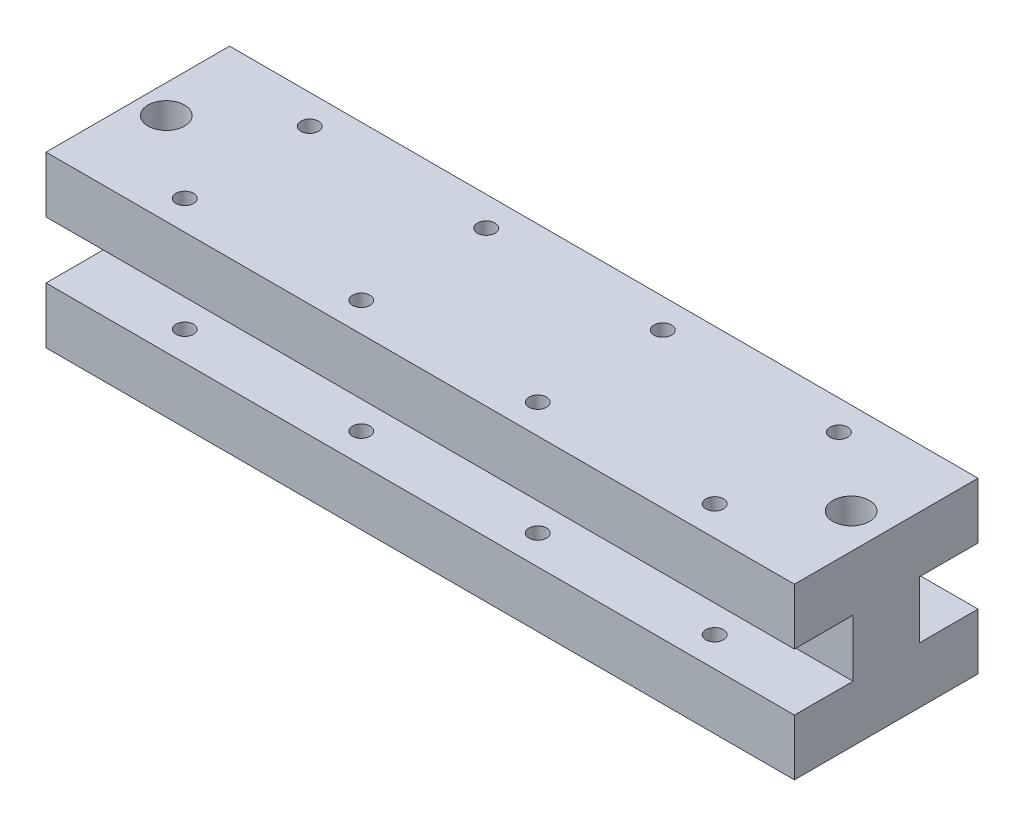
ISO-10303-21;
HEADER;
FILE_DESCRIPTION(('STEP AP214'),'2;1');
FILE_NAME('part.step','',(''),(''),'','','');
FILE_SCHEMA(('AUTOMOTIVE_DESIGN { 1 0 10303 214 1 1 1 1 }'));
ENDSEC;
DATA;
#1=APPLICATION_CONTEXT('core data for automotive mechanical design processes');
#2=APPLICATION_PROTOCOL_DEFINITION('international standard','automotive_design',2000,#1);
#3=PRODUCT_CONTEXT('',#1,'mechanical');
#4=PRODUCT('Part','Part','',(#3));
#5=PRODUCT_RELATED_PRODUCT_CATEGORY('part','',(#4));
#6=PRODUCT_DEFINITION_FORMATION('','',#4);
#7=PRODUCT_DEFINITION_CONTEXT('part definition',#1,'design');
#8=PRODUCT_DEFINITION('design','',#6,#7);
#9=PRODUCT_DEFINITION_SHAPE('','',#8);
#10=(LENGTH_UNIT() NAMED_UNIT(*) SI_UNIT(.MILLI.,.METRE.));
#11=(NAMED_UNIT(*) PLANE_ANGLE_UNIT() SI_UNIT($,.RADIAN.));
#12=(NAMED_UNIT(*) SI_UNIT($,.STERADIAN.) SOLID_ANGLE_UNIT());
#13=UNCERTAINTY_MEASURE_WITH_UNIT(LENGTH_MEASURE(1.E-05),#10,'distance_accuracy_value','');
#14=(GEOMETRIC_REPRESENTATION_CONTEXT(3) GLOBAL_UNCERTAINTY_ASSIGNED_CONTEXT((#13)) GLOBAL_UNIT_ASSIGNED_CONTEXT((#10,
#11,#12)) REPRESENTATION_CONTEXT('',''));
#15=CARTESIAN_POINT('',(0.,0.,0.));
#16=DIRECTION('',(0.,0.,1.));
#17=DIRECTION('',(1.,0.,0.));
#18=AXIS2_PLACEMENT_3D('',#15,#16,#17);
#19=CARTESIAN_POINT('',(-89.8910476017454,-40.65,-13.));
#20=DIRECTION('',(0.,-1.,0.));
#21=DIRECTION('',(0.,0.,-1.));
#22=AXIS2_PLACEMENT_3D('',#19,#20,#21);
#23=PLANE('',#22);
#24=CARTESIAN_POINT('',(11.1406049226985,-40.65,-13.));
#25=DIRECTION('',(0.,-1.,0.));
#26=DIRECTION('',(0.,0.,-1.));
#27=AXIS2_PLACEMENT_3D('',#24,#25,#26);
#28=CIRCLE('',#27,2.59079999999999);
#29=CARTESIAN_POINT('',(11.1406049226985,-40.65,-15.5908));
#30=VERTEX_POINT('',#29);
#31=EDGE_CURVE('E359',#30,#30,#28,.T.);
#32=ORIENTED_EDGE('',*,*,#31,.F.);
#33=EDGE_LOOP('',(#32));
#34=FACE_BOUND('',#33,.T.);
#35=CARTESIAN_POINT('',(-85.8542346336675,-40.65,-13.));
#36=DIRECTION('',(0.,-1.,0.));
#37=DIRECTION('',(0.,0.,-1.));
#38=AXIS2_PLACEMENT_3D('',#35,#36,#37);
#39=CIRCLE('',#38,2.59079999999999);
#40=CARTESIAN_POINT('',(-85.8542346336675,-40.65,-15.5908));
#41=VERTEX_POINT('',#40);
#42=EDGE_CURVE('E353',#41,#41,#39,.T.);
#43=ORIENTED_EDGE('',*,*,#42,.F.);
#44=EDGE_LOOP('',(#43));
#45=FACE_BOUND('',#44,.T.);
#46=DIRECTION('',(1.,0.,0.));
#47=VECTOR('',#46,1.);
#48=CARTESIAN_POINT('',(-89.8910476017454,-40.65,0.));
#49=LINE('',#48,#47);
#50=CARTESIAN_POINT('',(-89.8910476017454,-40.65,0.));
#51=VERTEX_POINT('',#50);
#52=CARTESIAN_POINT('',(16.1089523982546,-40.65,0.));
#53=VERTEX_POINT('',#52);
#54=EDGE_CURVE('E231',#51,#53,#49,.T.);
#55=ORIENTED_EDGE('',*,*,#54,.F.);
#56=DIRECTION('',(0.,0.,1.));
#57=VECTOR('',#56,1.);
#58=CARTESIAN_POINT('',(-89.8910476017454,-40.65,-13.));
#59=LINE('',#58,#57);
#60=CARTESIAN_POINT('',(-89.8910476017454,-40.65,-26.));
#61=VERTEX_POINT('',#60);
#62=EDGE_CURVE('E241',#61,#51,#59,.T.);
#63=ORIENTED_EDGE('',*,*,#62,.F.);
#64=DIRECTION('',(1.,0.,0.));
#65=VECTOR('',#64,1.);
#66=CARTESIAN_POINT('',(-89.8910476017454,-40.65,-26.));
#67=LINE('',#66,#65);
#68=CARTESIAN_POINT('',(16.1089523982546,-40.65,-26.));
#69=VERTEX_POINT('',#68);
#70=EDGE_CURVE('E163',#61,#69,#67,.T.);
#71=ORIENTED_EDGE('',*,*,#70,.T.);
#72=DIRECTION('',(0.,0.,1.));
#73=VECTOR('',#72,1.);
#74=CARTESIAN_POINT('',(16.1089523982546,-40.65,-13.));
#75=LINE('',#74,#73);
#76=EDGE_CURVE('E248',#69,#53,#75,.T.);
#77=ORIENTED_EDGE('',*,*,#76,.T.);
#78=EDGE_LOOP('',(#55,#63,#71,#77));
#79=FACE_BOUND('',#78,.T.);
#80=CARTESIAN_POINT('',(-24.3909856023909,-40.65,-4.15));
#81=DIRECTION('',(0.,1.,0.));
#82=DIRECTION('',(0.,0.,1.));
#83=AXIS2_PLACEMENT_3D('',#80,#81,#82);
#84=CIRCLE('',#83,1.25);
#85=CARTESIAN_POINT('',(-24.3909856023909,-40.65,-2.9));
#86=VERTEX_POINT('',#85);
#87=EDGE_CURVE('E201',#86,#86,#84,.T.);
#88=ORIENTED_EDGE('',*,*,#87,.T.);
#89=EDGE_LOOP('',(#88));
#90=FACE_BOUND('',#89,.T.);
#91=CARTESIAN_POINT('',(0.608952398254592,-40.65,-4.20567731927423));
#92=DIRECTION('',(0.,1.,0.));
#93=DIRECTION('',(0.,0.,1.));
#94=AXIS2_PLACEMENT_3D('',#91,#92,#93);
#95=CIRCLE('',#94,1.25);
#96=CARTESIAN_POINT('',(0.608952398254592,-40.65,-2.95567731927423));
#97=VERTEX_POINT('',#96);
#98=EDGE_CURVE('E189',#97,#97,#95,.T.);
#99=ORIENTED_EDGE('',*,*,#98,.T.);
#100=EDGE_LOOP('',(#99));
#101=FACE_BOUND('',#100,.T.);
#102=CARTESIAN_POINT('',(-49.3909856023909,-40.65,-4.15));
#103=DIRECTION('',(0.,1.,0.));
#104=DIRECTION('',(0.,0.,1.));
#105=AXIS2_PLACEMENT_3D('',#102,#103,#104);
#106=CIRCLE('',#105,1.24999999999999);
#107=CARTESIAN_POINT('',(-49.3909856023909,-40.65,-2.90000000000001));
#108=VERTEX_POINT('',#107);
#109=EDGE_CURVE('E179',#108,#108,#106,.T.);
#110=ORIENTED_EDGE('',*,*,#109,.T.);
#111=EDGE_LOOP('',(#110));
#112=FACE_BOUND('',#111,.T.);
#113=CARTESIAN_POINT('',(-74.3909856023909,-40.65,-4.15));
#114=DIRECTION('',(0.,1.,0.));
#115=DIRECTION('',(0.,0.,1.));
#116=AXIS2_PLACEMENT_3D('',#113,#114,#115);
#117=CIRCLE('',#116,1.25);
#118=CARTESIAN_POINT('',(-74.3909856023909,-40.65,-2.9));
#119=VERTEX_POINT('',#118);
#120=EDGE_CURVE('E169',#119,#119,#117,.T.);
#121=ORIENTED_EDGE('',*,*,#120,.T.);
#122=EDGE_LOOP('',(#121));
#123=FACE_BOUND('',#122,.T.);
#124=CARTESIAN_POINT('',(-24.3909856023909,-40.65,-21.85));
#125=DIRECTION('',(0.,1.,0.));
#126=DIRECTION('',(0.,0.,1.));
#127=AXIS2_PLACEMENT_3D('',#124,#125,#126);
#128=CIRCLE('',#127,1.25);
#129=CARTESIAN_POINT('',(-24.3909856023909,-40.65,-20.6));
#130=VERTEX_POINT('',#129);
#131=EDGE_CURVE('E308',#130,#130,#128,.T.);
#132=ORIENTED_EDGE('',*,*,#131,.T.);
#133=EDGE_LOOP('',(#132));
#134=FACE_BOUND('',#133,.T.);
#135=CARTESIAN_POINT('',(0.608952398254592,-40.65,-21.7943226807258));
#136=DIRECTION('',(0.,1.,0.));
#137=DIRECTION('',(0.,0.,1.));
#138=AXIS2_PLACEMENT_3D('',#135,#136,#137);
#139=CIRCLE('',#138,1.25);
#140=CARTESIAN_POINT('',(0.608952398254592,-40.65,-20.5443226807258));
#141=VERTEX_POINT('',#140);
#142=EDGE_CURVE('E320',#141,#141,#139,.T.);
#143=ORIENTED_EDGE('',*,*,#142,.T.);
#144=EDGE_LOOP('',(#143));
#145=FACE_BOUND('',#144,.T.);
#146=CARTESIAN_POINT('',(-49.3909856023909,-40.65,-21.85));
#147=DIRECTION('',(0.,1.,0.));
#148=DIRECTION('',(0.,0.,1.));
#149=AXIS2_PLACEMENT_3D('',#146,#147,#148);
#150=CIRCLE('',#149,1.24999999999999);
#151=CARTESIAN_POINT('',(-49.3909856023909,-40.65,-20.6));
#152=VERTEX_POINT('',#151);
#153=EDGE_CURVE('E332',#152,#152,#150,.T.);
#154=ORIENTED_EDGE('',*,*,#153,.T.);
#155=EDGE_LOOP('',(#154));
#156=FACE_BOUND('',#155,.T.);
#157=CARTESIAN_POINT('',(-74.3909856023909,-40.65,-21.85));
#158=DIRECTION('',(0.,1.,0.));
#159=DIRECTION('',(0.,0.,1.));
#160=AXIS2_PLACEMENT_3D('',#157,#158,#159);
#161=CIRCLE('',#160,1.25);
#162=CARTESIAN_POINT('',(-74.3909856023909,-40.65,-20.6));
#163=VERTEX_POINT('',#162);
#164=EDGE_CURVE('E344',#163,#163,#161,.T.);
#165=ORIENTED_EDGE('',*,*,#164,.T.);
#166=EDGE_LOOP('',(#165));
#167=FACE_BOUND('',#166,.T.);
#168=ADVANCED_FACE('F37',(#34,#45,#79,#90,#101,#112,#123,#134,#145,#156,#167),#23,.T.);
#169=CARTESIAN_POINT('',(0.,0.,-26.));
#170=DIRECTION('',(0.,0.,-1.));
#171=DIRECTION('',(1.,0.,0.));
#172=AXIS2_PLACEMENT_3D('',#169,#170,#171);
#173=PLANE('',#172);
#174=DIRECTION('',(1.,0.,0.));
#175=VECTOR('',#174,1.);
#176=CARTESIAN_POINT('',(0.,-24.6013169762694,-26.));
#177=LINE('',#176,#175);
#178=CARTESIAN_POINT('',(-89.8910476017454,-24.6013169762694,-26.));
#179=VERTEX_POINT('',#178);
#180=CARTESIAN_POINT('',(16.1089523982546,-24.6013169762694,-26.));
#181=VERTEX_POINT('',#180);
#182=EDGE_CURVE('E11',#179,#181,#177,.T.);
#183=ORIENTED_EDGE('',*,*,#182,.F.);
#184=DIRECTION('',(0.,-1.,0.));
#185=VECTOR('',#184,1.);
#186=CARTESIAN_POINT('',(-89.8910476017454,-16.65,-26.));
#187=LINE('',#186,#185);
#188=CARTESIAN_POINT('',(-89.8910476017454,-16.65,-26.));
#189=VERTEX_POINT('',#188);
#190=EDGE_CURVE('E149',#189,#179,#187,.T.);
#191=ORIENTED_EDGE('',*,*,#190,.F.);
#192=DIRECTION('',(-1.,0.,0.));
#193=VECTOR('',#192,1.);
#194=CARTESIAN_POINT('',(-89.8910476017454,-16.65,-26.));
#195=LINE('',#194,#193);
#196=CARTESIAN_POINT('',(16.1089523982546,-16.65,-26.));
#197=VERTEX_POINT('',#196);
#198=EDGE_CURVE('E156',#197,#189,#195,.T.);
#199=ORIENTED_EDGE('',*,*,#198,.F.);
#200=DIRECTION('',(0.,1.,0.));
#201=VECTOR('',#200,1.);
#202=CARTESIAN_POINT('',(16.1089523982546,-16.65,-26.));
#203=LINE('',#202,#201);
#204=EDGE_CURVE('E159',#181,#197,#203,.T.);
#205=ORIENTED_EDGE('',*,*,#204,.F.);
#206=EDGE_LOOP('',(#183,#191,#199,#205));
#207=FACE_BOUND('',#206,.T.);
#208=ADVANCED_FACE('F299',(#207),#173,.T.);
#209=CARTESIAN_POINT('',(-89.8910476017454,-16.65,-13.));
#210=DIRECTION('',(-1.,0.,0.));
#211=DIRECTION('',(0.,0.,1.));
#212=AXIS2_PLACEMENT_3D('',#209,#210,#211);
#213=PLANE('',#212);
#214=DIRECTION('',(0.,0.,1.));
#215=VECTOR('',#214,1.);
#216=CARTESIAN_POINT('',(-89.8910476017454,-24.6013169762694,-26.000012));
#217=LINE('',#216,#215);
#218=CARTESIAN_POINT('',(-89.8910476017454,-24.6013169762694,-17.7));
#219=VERTEX_POINT('',#218);
#220=EDGE_CURVE('E129',#179,#219,#217,.T.);
#221=ORIENTED_EDGE('',*,*,#220,.T.);
#222=DIRECTION('',(0.,-1.,0.));
#223=VECTOR('',#222,1.);
#224=CARTESIAN_POINT('',(-89.8910476017454,-24.6013169762694,-17.7));
#225=LINE('',#224,#223);
#226=CARTESIAN_POINT('',(-89.8910476017454,-32.7013169762694,-17.7));
#227=VERTEX_POINT('',#226);
#228=EDGE_CURVE('E137',#219,#227,#225,.T.);
#229=ORIENTED_EDGE('',*,*,#228,.T.);
#230=DIRECTION('',(0.,0.,1.));
#231=VECTOR('',#230,1.);
#232=CARTESIAN_POINT('',(-89.8910476017454,-32.7013169762694,-26.000012));
#233=LINE('',#232,#231);
#234=CARTESIAN_POINT('',(-89.8910476017454,-32.7013169762694,-26.));
#235=VERTEX_POINT('',#234);
#236=EDGE_CURVE('E262',#235,#227,#233,.T.);
#237=ORIENTED_EDGE('',*,*,#236,.F.);
#238=EDGE_CURVE('E150',#235,#61,#187,.T.);
#239=ORIENTED_EDGE('',*,*,#238,.T.);
#240=ORIENTED_EDGE('',*,*,#62,.T.);
#241=DIRECTION('',(0.,-1.,0.));
#242=VECTOR('',#241,1.);
#243=CARTESIAN_POINT('',(-89.8910476017454,-16.65,0.));
#244=LINE('',#243,#242);
#245=CARTESIAN_POINT('',(-89.8910476017454,-32.7013169762694,0.));
#246=VERTEX_POINT('',#245);
#247=EDGE_CURVE('E227',#246,#51,#244,.T.);
#248=ORIENTED_EDGE('',*,*,#247,.F.);
#249=DIRECTION('',(0.,0.,-1.));
#250=VECTOR('',#249,1.);
#251=CARTESIAN_POINT('',(-89.8910476017454,-32.7013169762694,1.2E-05));
#252=LINE('',#251,#250);
#253=CARTESIAN_POINT('',(-89.8910476017454,-32.7013169762694,-8.3));
#254=VERTEX_POINT('',#253);
#255=EDGE_CURVE('E224',#246,#254,#252,.T.);
#256=ORIENTED_EDGE('',*,*,#255,.T.);
#257=DIRECTION('',(0.,-1.,0.));
#258=VECTOR('',#257,1.);
#259=CARTESIAN_POINT('',(-89.8910476017454,-24.6013169762694,-8.3));
#260=LINE('',#259,#258);
#261=CARTESIAN_POINT('',(-89.8910476017454,-24.6013169762694,-8.3));
#262=VERTEX_POINT('',#261);
#263=EDGE_CURVE('E208',#262,#254,#260,.T.);
#264=ORIENTED_EDGE('',*,*,#263,.F.);
#265=DIRECTION('',(0.,0.,-1.));
#266=VECTOR('',#265,1.);
#267=CARTESIAN_POINT('',(-89.8910476017454,-24.6013169762694,1.2E-05));
#268=LINE('',#267,#266);
#269=CARTESIAN_POINT('',(-89.8910476017454,-24.6013169762694,0.));
#270=VERTEX_POINT('',#269);
#271=EDGE_CURVE('E219',#270,#262,#268,.T.);
#272=ORIENTED_EDGE('',*,*,#271,.F.);
#273=CARTESIAN_POINT('',(-89.8910476017454,-16.65,0.));
#274=VERTEX_POINT('',#273);
#275=EDGE_CURVE('E228',#274,#270,#244,.T.);
#276=ORIENTED_EDGE('',*,*,#275,.F.);
#277=DIRECTION('',(0.,0.,1.));
#278=VECTOR('',#277,1.);
#279=CARTESIAN_POINT('',(-89.8910476017454,-16.65,-13.));
#280=LINE('',#279,#278);
#281=EDGE_CURVE('E242',#189,#274,#280,.T.);
#282=ORIENTED_EDGE('',*,*,#281,.F.);
#283=ORIENTED_EDGE('',*,*,#190,.T.);
#284=EDGE_LOOP('',(#221,#229,#237,#239,#240,#248,#256,#264,#272,#276,#282,#283));
#285=FACE_BOUND('',#284,.T.);
#286=ADVANCED_FACE('F39',(#285),#213,.T.);
#287=CARTESIAN_POINT('',(16.1089523982546,-16.65,-13.));
#288=DIRECTION('',(1.,0.,0.));
#289=DIRECTION('',(0.,1.,0.));
#290=AXIS2_PLACEMENT_3D('',#287,#288,#289);
#291=PLANE('',#290);
#292=DIRECTION('',(0.,0.,1.));
#293=VECTOR('',#292,1.);
#294=CARTESIAN_POINT('',(16.1089523982546,-24.6013169762694,-26.000012));
#295=LINE('',#294,#293);
#296=CARTESIAN_POINT('',(16.1089523982546,-24.6013169762694,-17.7));
#297=VERTEX_POINT('',#296);
#298=EDGE_CURVE('E132',#181,#297,#295,.T.);
#299=ORIENTED_EDGE('',*,*,#298,.F.);
#300=ORIENTED_EDGE('',*,*,#204,.T.);
#301=DIRECTION('',(0.,0.,1.));
#302=VECTOR('',#301,1.);
#303=CARTESIAN_POINT('',(16.1089523982546,-16.65,-13.));
#304=LINE('',#303,#302);
#305=CARTESIAN_POINT('',(16.1089523982546,-16.65,0.));
#306=VERTEX_POINT('',#305);
#307=EDGE_CURVE('E245',#197,#306,#304,.T.);
#308=ORIENTED_EDGE('',*,*,#307,.T.);
#309=DIRECTION('',(0.,1.,0.));
#310=VECTOR('',#309,1.);
#311=CARTESIAN_POINT('',(16.1089523982546,-16.65,0.));
#312=LINE('',#311,#310);
#313=CARTESIAN_POINT('',(16.1089523982546,-24.6013169762694,0.));
#314=VERTEX_POINT('',#313);
#315=EDGE_CURVE('E234',#314,#306,#312,.T.);
#316=ORIENTED_EDGE('',*,*,#315,.F.);
#317=DIRECTION('',(0.,0.,-1.));
#318=VECTOR('',#317,1.);
#319=CARTESIAN_POINT('',(16.1089523982546,-24.6013169762694,1.2E-05));
#320=LINE('',#319,#318);
#321=CARTESIAN_POINT('',(16.1089523982546,-24.6013169762694,-8.3));
#322=VERTEX_POINT('',#321);
#323=EDGE_CURVE('E60',#314,#322,#320,.T.);
#324=ORIENTED_EDGE('',*,*,#323,.T.);
#325=DIRECTION('',(0.,1.,0.));
#326=VECTOR('',#325,1.);
#327=CARTESIAN_POINT('',(16.1089523982546,-24.6013169762694,-8.3));
#328=LINE('',#327,#326);
#329=CARTESIAN_POINT('',(16.1089523982546,-32.7013169762694,-8.3));
#330=VERTEX_POINT('',#329);
#331=EDGE_CURVE('E214',#330,#322,#328,.T.);
#332=ORIENTED_EDGE('',*,*,#331,.F.);
#333=DIRECTION('',(0.,0.,-1.));
#334=VECTOR('',#333,1.);
#335=CARTESIAN_POINT('',(16.1089523982546,-32.7013169762694,1.2E-05));
#336=LINE('',#335,#334);
#337=CARTESIAN_POINT('',(16.1089523982546,-32.7013169762694,0.));
#338=VERTEX_POINT('',#337);
#339=EDGE_CURVE('E222',#338,#330,#336,.T.);
#340=ORIENTED_EDGE('',*,*,#339,.F.);
#341=EDGE_CURVE('E235',#53,#338,#312,.T.);
#342=ORIENTED_EDGE('',*,*,#341,.F.);
#343=ORIENTED_EDGE('',*,*,#76,.F.);
#344=CARTESIAN_POINT('',(16.1089523982546,-32.7013169762694,-26.));
#345=VERTEX_POINT('',#344);
#346=EDGE_CURVE('E160',#69,#345,#203,.T.);
#347=ORIENTED_EDGE('',*,*,#346,.T.);
#348=DIRECTION('',(0.,0.,1.));
#349=VECTOR('',#348,1.);
#350=CARTESIAN_POINT('',(16.1089523982546,-32.7013169762694,-26.000012));
#351=LINE('',#350,#349);
#352=CARTESIAN_POINT('',(16.1089523982546,-32.7013169762694,-17.7));
#353=VERTEX_POINT('',#352);
#354=EDGE_CURVE('E52',#345,#353,#351,.T.);
#355=ORIENTED_EDGE('',*,*,#354,.T.);
#356=DIRECTION('',(0.,1.,0.));
#357=VECTOR('',#356,1.);
#358=CARTESIAN_POINT('',(16.1089523982546,-24.6013169762694,-17.7));
#359=LINE('',#358,#357);
#360=EDGE_CURVE('E136',#353,#297,#359,.T.);
#361=ORIENTED_EDGE('',*,*,#360,.T.);
#362=EDGE_LOOP('',(#299,#300,#308,#316,#324,#332,#340,#342,#343,#347,#355,#361));
#363=FACE_BOUND('',#362,.T.);
#364=ADVANCED_FACE('F283',(#363),#291,.T.);
#365=CARTESIAN_POINT('',(0.,0.,0.));
#366=DIRECTION('',(0.,0.,1.));
#367=DIRECTION('',(1.,0.,0.));
#368=AXIS2_PLACEMENT_3D('',#365,#366,#367);
#369=PLANE('',#368);
#370=ORIENTED_EDGE('',*,*,#341,.T.);
#371=DIRECTION('',(-1.,0.,0.));
#372=VECTOR('',#371,1.);
#373=CARTESIAN_POINT('',(0.,-32.7013169762694,0.));
#374=LINE('',#373,#372);
#375=EDGE_CURVE('E253',#338,#246,#374,.T.);
#376=ORIENTED_EDGE('',*,*,#375,.T.);
#377=ORIENTED_EDGE('',*,*,#247,.T.);
#378=ORIENTED_EDGE('',*,*,#54,.T.);
#379=EDGE_LOOP('',(#370,#376,#377,#378));
#380=FACE_BOUND('',#379,.T.);
#381=ADVANCED_FACE('F277',(#380),#369,.T.);
#382=ORIENTED_EDGE('',*,*,#275,.T.);
#383=DIRECTION('',(1.,0.,0.));
#384=VECTOR('',#383,1.);
#385=CARTESIAN_POINT('',(0.,-24.6013169762694,0.));
#386=LINE('',#385,#384);
#387=EDGE_CURVE('E244',#270,#314,#386,.T.);
#388=ORIENTED_EDGE('',*,*,#387,.T.);
#389=ORIENTED_EDGE('',*,*,#315,.T.);
#390=DIRECTION('',(-1.,0.,0.));
#391=VECTOR('',#390,1.);
#392=CARTESIAN_POINT('',(-89.8910476017454,-16.65,0.));
#393=LINE('',#392,#391);
#394=EDGE_CURVE('E238',#306,#274,#393,.T.);
#395=ORIENTED_EDGE('',*,*,#394,.T.);
#396=EDGE_LOOP('',(#382,#388,#389,#395));
#397=FACE_BOUND('',#396,.T.);
#398=ADVANCED_FACE('F291',(#397),#369,.T.);
#399=CARTESIAN_POINT('',(-89.8910476017454,-16.65,-13.));
#400=DIRECTION('',(0.,1.,0.));
#401=DIRECTION('',(0.,0.,1.));
#402=AXIS2_PLACEMENT_3D('',#399,#400,#401);
#403=PLANE('',#402);
#404=CARTESIAN_POINT('',(11.1406049226985,-16.65,-13.));
#405=DIRECTION('',(0.,-1.,0.));
#406=DIRECTION('',(0.,0.,-1.));
#407=AXIS2_PLACEMENT_3D('',#404,#405,#406);
#408=CIRCLE('',#407,2.59079999999999);
#409=CARTESIAN_POINT('',(11.1406049226985,-16.65,-15.5908));
#410=VERTEX_POINT('',#409);
#411=EDGE_CURVE('E356',#410,#410,#408,.T.);
#412=ORIENTED_EDGE('',*,*,#411,.T.);
#413=EDGE_LOOP('',(#412));
#414=FACE_BOUND('',#413,.T.);
#415=CARTESIAN_POINT('',(-85.8542346336675,-16.65,-13.));
#416=DIRECTION('',(0.,-1.,0.));
#417=DIRECTION('',(0.,0.,-1.));
#418=AXIS2_PLACEMENT_3D('',#415,#416,#417);
#419=CIRCLE('',#418,2.59079999999999);
#420=CARTESIAN_POINT('',(-85.8542346336675,-16.65,-15.5908));
#421=VERTEX_POINT('',#420);
#422=EDGE_CURVE('E350',#421,#421,#419,.T.);
#423=ORIENTED_EDGE('',*,*,#422,.T.);
#424=EDGE_LOOP('',(#423));
#425=FACE_BOUND('',#424,.T.);
#426=CARTESIAN_POINT('',(-74.3909856023909,-16.65,-21.85));
#427=DIRECTION('',(0.,1.,0.));
#428=DIRECTION('',(0.,0.,1.));
#429=AXIS2_PLACEMENT_3D('',#426,#427,#428);
#430=CIRCLE('',#429,1.25);
#431=CARTESIAN_POINT('',(-74.3909856023909,-16.65,-20.6));
#432=VERTEX_POINT('',#431);
#433=EDGE_CURVE('E347',#432,#432,#430,.T.);
#434=ORIENTED_EDGE('',*,*,#433,.F.);
#435=EDGE_LOOP('',(#434));
#436=FACE_BOUND('',#435,.T.);
#437=CARTESIAN_POINT('',(-49.3909856023909,-16.65,-21.85));
#438=DIRECTION('',(0.,1.,0.));
#439=DIRECTION('',(0.,0.,1.));
#440=AXIS2_PLACEMENT_3D('',#437,#438,#439);
#441=CIRCLE('',#440,1.24999999999999);
#442=CARTESIAN_POINT('',(-49.3909856023909,-16.65,-20.6));
#443=VERTEX_POINT('',#442);
#444=EDGE_CURVE('E335',#443,#443,#441,.T.);
#445=ORIENTED_EDGE('',*,*,#444,.F.);
#446=EDGE_LOOP('',(#445));
#447=FACE_BOUND('',#446,.T.);
#448=CARTESIAN_POINT('',(0.608952398254592,-16.65,-21.7943226807258));
#449=DIRECTION('',(0.,1.,0.));
#450=DIRECTION('',(0.,0.,1.));
#451=AXIS2_PLACEMENT_3D('',#448,#449,#450);
#452=CIRCLE('',#451,1.25);
#453=CARTESIAN_POINT('',(0.608952398254592,-16.65,-20.5443226807258));
#454=VERTEX_POINT('',#453);
#455=EDGE_CURVE('E323',#454,#454,#452,.T.);
#456=ORIENTED_EDGE('',*,*,#455,.F.);
#457=EDGE_LOOP('',(#456));
#458=FACE_BOUND('',#457,.T.);
#459=CARTESIAN_POINT('',(-24.3909856023909,-16.65,-21.85));
#460=DIRECTION('',(0.,1.,0.));
#461=DIRECTION('',(0.,0.,1.));
#462=AXIS2_PLACEMENT_3D('',#459,#460,#461);
#463=CIRCLE('',#462,1.25);
#464=CARTESIAN_POINT('',(-24.3909856023909,-16.65,-20.6));
#465=VERTEX_POINT('',#464);
#466=EDGE_CURVE('E311',#465,#465,#463,.T.);
#467=ORIENTED_EDGE('',*,*,#466,.F.);
#468=EDGE_LOOP('',(#467));
#469=FACE_BOUND('',#468,.T.);
#470=CARTESIAN_POINT('',(-74.3909856023909,-16.65,-4.15));
#471=DIRECTION('',(0.,1.,0.));
#472=DIRECTION('',(0.,0.,1.));
#473=AXIS2_PLACEMENT_3D('',#470,#471,#472);
#474=CIRCLE('',#473,1.25);
#475=CARTESIAN_POINT('',(-74.3909856023909,-16.65,-2.9));
#476=VERTEX_POINT('',#475);
#477=EDGE_CURVE('E166',#476,#476,#474,.T.);
#478=ORIENTED_EDGE('',*,*,#477,.F.);
#479=EDGE_LOOP('',(#478));
#480=FACE_BOUND('',#479,.T.);
#481=CARTESIAN_POINT('',(-49.3909856023909,-16.65,-4.15));
#482=DIRECTION('',(0.,1.,0.));
#483=DIRECTION('',(0.,0.,1.));
#484=AXIS2_PLACEMENT_3D('',#481,#482,#483);
#485=CIRCLE('',#484,1.24999999999999);
#486=CARTESIAN_POINT('',(-49.3909856023909,-16.65,-2.90000000000001));
#487=VERTEX_POINT('',#486);
#488=EDGE_CURVE('E176',#487,#487,#485,.T.);
#489=ORIENTED_EDGE('',*,*,#488,.F.);
#490=EDGE_LOOP('',(#489));
#491=FACE_BOUND('',#490,.T.);
#492=CARTESIAN_POINT('',(0.608952398254592,-16.65,-4.20567731927423));
#493=DIRECTION('',(0.,1.,0.));
#494=DIRECTION('',(0.,0.,1.));
#495=AXIS2_PLACEMENT_3D('',#492,#493,#494);
#496=CIRCLE('',#495,1.25);
#497=CARTESIAN_POINT('',(0.608952398254592,-16.65,-2.95567731927423));
#498=VERTEX_POINT('',#497);
#499=EDGE_CURVE('E186',#498,#498,#496,.T.);
#500=ORIENTED_EDGE('',*,*,#499,.F.);
#501=EDGE_LOOP('',(#500));
#502=FACE_BOUND('',#501,.T.);
#503=CARTESIAN_POINT('',(-24.3909856023909,-16.65,-4.15));
#504=DIRECTION('',(0.,1.,0.));
#505=DIRECTION('',(0.,0.,1.));
#506=AXIS2_PLACEMENT_3D('',#503,#504,#505);
#507=CIRCLE('',#506,1.25);
#508=CARTESIAN_POINT('',(-24.3909856023909,-16.65,-2.9));
#509=VERTEX_POINT('',#508);
#510=EDGE_CURVE('E198',#509,#509,#507,.T.);
#511=ORIENTED_EDGE('',*,*,#510,.F.);
#512=EDGE_LOOP('',(#511));
#513=FACE_BOUND('',#512,.T.);
#514=ORIENTED_EDGE('',*,*,#394,.F.);
#515=ORIENTED_EDGE('',*,*,#307,.F.);
#516=ORIENTED_EDGE('',*,*,#198,.T.);
#517=ORIENTED_EDGE('',*,*,#281,.T.);
#518=EDGE_LOOP('',(#514,#515,#516,#517));
#519=FACE_BOUND('',#518,.T.);
#520=ADVANCED_FACE('F295',(#414,#425,#436,#447,#458,#469,#480,#491,#502,#513,#519),#403,.T.);
#521=CARTESIAN_POINT('',(-89.8910476017454,-32.7013169762694,1.2E-05));
#522=DIRECTION('',(0.,1.,0.));
#523=DIRECTION('',(0.,0.,1.));
#524=AXIS2_PLACEMENT_3D('',#521,#522,#523);
#525=PLANE('',#524);
#526=CARTESIAN_POINT('',(-74.3909856023909,-32.7013169762694,-4.15));
#527=DIRECTION('',(0.,1.,0.));
#528=DIRECTION('',(0.,0.,1.));
#529=AXIS2_PLACEMENT_3D('',#526,#527,#528);
#530=CIRCLE('',#529,1.25);
#531=CARTESIAN_POINT('',(-74.3909856023909,-32.7013169762694,-2.9));
#532=VERTEX_POINT('',#531);
#533=EDGE_CURVE('E173',#532,#532,#530,.T.);
#534=ORIENTED_EDGE('',*,*,#533,.F.);
#535=EDGE_LOOP('',(#534));
#536=FACE_BOUND('',#535,.T.);
#537=CARTESIAN_POINT('',(-49.3909856023909,-32.7013169762694,-4.15));
#538=DIRECTION('',(0.,1.,0.));
#539=DIRECTION('',(0.,0.,1.));
#540=AXIS2_PLACEMENT_3D('',#537,#538,#539);
#541=CIRCLE('',#540,1.24999999999999);
#542=CARTESIAN_POINT('',(-49.3909856023909,-32.7013169762694,-2.90000000000001));
#543=VERTEX_POINT('',#542);
#544=EDGE_CURVE('E183',#543,#543,#541,.T.);
#545=ORIENTED_EDGE('',*,*,#544,.F.);
#546=EDGE_LOOP('',(#545));
#547=FACE_BOUND('',#546,.T.);
#548=CARTESIAN_POINT('',(0.608952398254592,-32.7013169762694,-4.20567731927423));
#549=DIRECTION('',(0.,1.,0.));
#550=DIRECTION('',(0.,0.,1.));
#551=AXIS2_PLACEMENT_3D('',#548,#549,#550);
#552=CIRCLE('',#551,1.25);
#553=CARTESIAN_POINT('',(0.608952398254592,-32.7013169762694,-2.95567731927423));
#554=VERTEX_POINT('',#553);
#555=EDGE_CURVE('E195',#554,#554,#552,.T.);
#556=ORIENTED_EDGE('',*,*,#555,.F.);
#557=EDGE_LOOP('',(#556));
#558=FACE_BOUND('',#557,.T.);
#559=CARTESIAN_POINT('',(-24.3909856023909,-32.7013169762694,-4.15));
#560=DIRECTION('',(0.,1.,0.));
#561=DIRECTION('',(0.,0.,1.));
#562=AXIS2_PLACEMENT_3D('',#559,#560,#561);
#563=CIRCLE('',#562,1.25);
#564=CARTESIAN_POINT('',(-24.3909856023909,-32.7013169762694,-2.9));
#565=VERTEX_POINT('',#564);
#566=EDGE_CURVE('E205',#565,#565,#563,.T.);
#567=ORIENTED_EDGE('',*,*,#566,.F.);
#568=EDGE_LOOP('',(#567));
#569=FACE_BOUND('',#568,.T.);
#570=ORIENTED_EDGE('',*,*,#339,.T.);
#571=DIRECTION('',(1.,0.,0.));
#572=VECTOR('',#571,1.);
#573=CARTESIAN_POINT('',(-89.8910476017454,-32.7013169762694,-8.3));
#574=LINE('',#573,#572);
#575=EDGE_CURVE('E211',#254,#330,#574,.T.);
#576=ORIENTED_EDGE('',*,*,#575,.F.);
#577=ORIENTED_EDGE('',*,*,#255,.F.);
#578=ORIENTED_EDGE('',*,*,#375,.F.);
#579=EDGE_LOOP('',(#570,#576,#577,#578));
#580=FACE_BOUND('',#579,.T.);
#581=ADVANCED_FACE('F280',(#536,#547,#558,#569,#580),#525,.T.);
#582=CARTESIAN_POINT('',(-89.8910476017454,-24.6013169762694,1.2E-05));
#583=DIRECTION('',(0.,-1.,0.));
#584=DIRECTION('',(0.,0.,-1.));
#585=AXIS2_PLACEMENT_3D('',#582,#583,#584);
#586=PLANE('',#585);
#587=CARTESIAN_POINT('',(-74.3909856023909,-24.6013169762694,-4.15));
#588=DIRECTION('',(0.,-1.,0.));
#589=DIRECTION('',(0.,0.,-1.));
#590=AXIS2_PLACEMENT_3D('',#587,#588,#589);
#591=CIRCLE('',#590,1.25);
#592=CARTESIAN_POINT('',(-74.3909856023909,-24.6013169762694,-5.4));
#593=VERTEX_POINT('',#592);
#594=EDGE_CURVE('E172',#593,#593,#591,.T.);
#595=ORIENTED_EDGE('',*,*,#594,.F.);
#596=EDGE_LOOP('',(#595));
#597=FACE_BOUND('',#596,.T.);
#598=CARTESIAN_POINT('',(-49.3909856023909,-24.6013169762694,-4.15));
#599=DIRECTION('',(0.,-1.,0.));
#600=DIRECTION('',(0.,0.,-1.));
#601=AXIS2_PLACEMENT_3D('',#598,#599,#600);
#602=CIRCLE('',#601,1.24999999999999);
#603=CARTESIAN_POINT('',(-49.3909856023909,-24.6013169762694,-5.39999999999999));
#604=VERTEX_POINT('',#603);
#605=EDGE_CURVE('E182',#604,#604,#602,.T.);
#606=ORIENTED_EDGE('',*,*,#605,.F.);
#607=EDGE_LOOP('',(#606));
#608=FACE_BOUND('',#607,.T.);
#609=CARTESIAN_POINT('',(0.608952398254592,-24.6013169762694,-4.20567731927423));
#610=DIRECTION('',(0.,-1.,0.));
#611=DIRECTION('',(0.,0.,-1.));
#612=AXIS2_PLACEMENT_3D('',#609,#610,#611);
#613=CIRCLE('',#612,1.25);
#614=CARTESIAN_POINT('',(0.608952398254592,-24.6013169762694,-5.45567731927422));
#615=VERTEX_POINT('',#614);
#616=EDGE_CURVE('E192',#615,#615,#613,.T.);
#617=ORIENTED_EDGE('',*,*,#616,.F.);
#618=EDGE_LOOP('',(#617));
#619=FACE_BOUND('',#618,.T.);
#620=CARTESIAN_POINT('',(-24.3909856023909,-24.6013169762694,-4.15));
#621=DIRECTION('',(0.,-1.,0.));
#622=DIRECTION('',(0.,0.,-1.));
#623=AXIS2_PLACEMENT_3D('',#620,#621,#622);
#624=CIRCLE('',#623,1.25);
#625=CARTESIAN_POINT('',(-24.3909856023909,-24.6013169762694,-5.4));
#626=VERTEX_POINT('',#625);
#627=EDGE_CURVE('E204',#626,#626,#624,.T.);
#628=ORIENTED_EDGE('',*,*,#627,.F.);
#629=EDGE_LOOP('',(#628));
#630=FACE_BOUND('',#629,.T.);
#631=ORIENTED_EDGE('',*,*,#271,.T.);
#632=DIRECTION('',(-1.,0.,0.));
#633=VECTOR('',#632,1.);
#634=CARTESIAN_POINT('',(-89.8910476017454,-24.6013169762694,-8.3));
#635=LINE('',#634,#633);
#636=EDGE_CURVE('E216',#322,#262,#635,.T.);
#637=ORIENTED_EDGE('',*,*,#636,.F.);
#638=ORIENTED_EDGE('',*,*,#323,.F.);
#639=ORIENTED_EDGE('',*,*,#387,.F.);
#640=EDGE_LOOP('',(#631,#637,#638,#639));
#641=FACE_BOUND('',#640,.T.);
#642=ADVANCED_FACE('F287',(#597,#608,#619,#630,#641),#586,.T.);
#643=CARTESIAN_POINT('',(0.,0.,-8.3));
#644=DIRECTION('',(0.,0.,1.));
#645=DIRECTION('',(1.,0.,0.));
#646=AXIS2_PLACEMENT_3D('',#643,#644,#645);
#647=PLANE('',#646);
#648=ORIENTED_EDGE('',*,*,#263,.T.);
#649=ORIENTED_EDGE('',*,*,#575,.T.);
#650=ORIENTED_EDGE('',*,*,#331,.T.);
#651=ORIENTED_EDGE('',*,*,#636,.T.);
#652=EDGE_LOOP('',(#648,#649,#650,#651));
#653=FACE_BOUND('',#652,.T.);
#654=ADVANCED_FACE('F286',(#653),#647,.T.);
#655=CARTESIAN_POINT('',(-24.3909856023909,-16.65,-4.15));
#656=DIRECTION('',(0.,1.,0.));
#657=DIRECTION('',(0.,0.,1.));
#658=AXIS2_PLACEMENT_3D('',#655,#656,#657);
#659=CYLINDRICAL_SURFACE('',#658,1.25);
#660=ORIENTED_EDGE('',*,*,#627,.T.);
#661=EDGE_LOOP('',(#660));
#662=FACE_BOUND('',#661,.T.);
#663=ORIENTED_EDGE('',*,*,#510,.T.);
#664=EDGE_LOOP('',(#663));
#665=FACE_BOUND('',#664,.T.);
#666=ADVANCED_FACE('F426',(#662,#665),#659,.F.);
#667=ORIENTED_EDGE('',*,*,#566,.T.);
#668=EDGE_LOOP('',(#667));
#669=FACE_BOUND('',#668,.T.);
#670=ORIENTED_EDGE('',*,*,#87,.F.);
#671=EDGE_LOOP('',(#670));
#672=FACE_BOUND('',#671,.T.);
#673=ADVANCED_FACE('F424',(#669,#672),#659,.F.);
#674=CARTESIAN_POINT('',(0.608952398254592,-16.65,-4.20567731927423));
#675=DIRECTION('',(0.,1.,0.));
#676=DIRECTION('',(0.,0.,1.));
#677=AXIS2_PLACEMENT_3D('',#674,#675,#676);
#678=CYLINDRICAL_SURFACE('',#677,1.25);
#679=ORIENTED_EDGE('',*,*,#616,.T.);
#680=EDGE_LOOP('',(#679));
#681=FACE_BOUND('',#680,.T.);
#682=ORIENTED_EDGE('',*,*,#499,.T.);
#683=EDGE_LOOP('',(#682));
#684=FACE_BOUND('',#683,.T.);
#685=ADVANCED_FACE('F421',(#681,#684),#678,.F.);
#686=ORIENTED_EDGE('',*,*,#555,.T.);
#687=EDGE_LOOP('',(#686));
#688=FACE_BOUND('',#687,.T.);
#689=ORIENTED_EDGE('',*,*,#98,.F.);
#690=EDGE_LOOP('',(#689));
#691=FACE_BOUND('',#690,.T.);
#692=ADVANCED_FACE('F419',(#688,#691),#678,.F.);
#693=CARTESIAN_POINT('',(-49.3909856023909,-16.65,-4.15));
#694=DIRECTION('',(0.,1.,0.));
#695=DIRECTION('',(0.,0.,1.));
#696=AXIS2_PLACEMENT_3D('',#693,#694,#695);
#697=CYLINDRICAL_SURFACE('',#696,1.24999999999999);
#698=ORIENTED_EDGE('',*,*,#605,.T.);
#699=EDGE_LOOP('',(#698));
#700=FACE_BOUND('',#699,.T.);
#701=ORIENTED_EDGE('',*,*,#488,.T.);
#702=EDGE_LOOP('',(#701));
#703=FACE_BOUND('',#702,.T.);
#704=ADVANCED_FACE('F416',(#700,#703),#697,.F.);
#705=ORIENTED_EDGE('',*,*,#544,.T.);
#706=EDGE_LOOP('',(#705));
#707=FACE_BOUND('',#706,.T.);
#708=ORIENTED_EDGE('',*,*,#109,.F.);
#709=EDGE_LOOP('',(#708));
#710=FACE_BOUND('',#709,.T.);
#711=ADVANCED_FACE('F414',(#707,#710),#697,.F.);
#712=CARTESIAN_POINT('',(-74.3909856023909,-16.65,-4.15));
#713=DIRECTION('',(0.,1.,0.));
#714=DIRECTION('',(0.,0.,1.));
#715=AXIS2_PLACEMENT_3D('',#712,#713,#714);
#716=CYLINDRICAL_SURFACE('',#715,1.25);
#717=ORIENTED_EDGE('',*,*,#594,.T.);
#718=EDGE_LOOP('',(#717));
#719=FACE_BOUND('',#718,.T.);
#720=ORIENTED_EDGE('',*,*,#477,.T.);
#721=EDGE_LOOP('',(#720));
#722=FACE_BOUND('',#721,.T.);
#723=ADVANCED_FACE('F411',(#719,#722),#716,.F.);
#724=ORIENTED_EDGE('',*,*,#533,.T.);
#725=EDGE_LOOP('',(#724));
#726=FACE_BOUND('',#725,.T.);
#727=ORIENTED_EDGE('',*,*,#120,.F.);
#728=EDGE_LOOP('',(#727));
#729=FACE_BOUND('',#728,.T.);
#730=ADVANCED_FACE('F410',(#726,#729),#716,.F.);
#731=DIRECTION('',(-1.,0.,0.));
#732=VECTOR('',#731,1.);
#733=CARTESIAN_POINT('',(0.,-32.7013169762694,-26.));
#734=LINE('',#733,#732);
#735=EDGE_CURVE('E45',#345,#235,#734,.T.);
#736=ORIENTED_EDGE('',*,*,#735,.F.);
#737=ORIENTED_EDGE('',*,*,#346,.F.);
#738=ORIENTED_EDGE('',*,*,#70,.F.);
#739=ORIENTED_EDGE('',*,*,#238,.F.);
#740=EDGE_LOOP('',(#736,#737,#738,#739));
#741=FACE_BOUND('',#740,.T.);
#742=ADVANCED_FACE('F269',(#741),#173,.T.);
#743=CARTESIAN_POINT('',(-89.8910476017454,-24.6013169762694,-26.000012));
#744=DIRECTION('',(0.,1.,0.));
#745=DIRECTION('',(0.,0.,1.));
#746=AXIS2_PLACEMENT_3D('',#743,#744,#745);
#747=PLANE('',#746);
#748=CARTESIAN_POINT('',(-74.3909856023909,-24.6013169762694,-21.85));
#749=DIRECTION('',(0.,1.,0.));
#750=DIRECTION('',(0.,0.,1.));
#751=AXIS2_PLACEMENT_3D('',#748,#749,#750);
#752=CIRCLE('',#751,1.25);
#753=CARTESIAN_POINT('',(-74.3909856023909,-24.6013169762694,-20.6));
#754=VERTEX_POINT('',#753);
#755=EDGE_CURVE('E341',#754,#754,#752,.T.);
#756=ORIENTED_EDGE('',*,*,#755,.T.);
#757=EDGE_LOOP('',(#756));
#758=FACE_BOUND('',#757,.T.);
#759=CARTESIAN_POINT('',(-49.3909856023909,-24.6013169762694,-21.85));
#760=DIRECTION('',(0.,1.,0.));
#761=DIRECTION('',(0.,0.,1.));
#762=AXIS2_PLACEMENT_3D('',#759,#760,#761);
#763=CIRCLE('',#762,1.24999999999999);
#764=CARTESIAN_POINT('',(-49.3909856023909,-24.6013169762694,-20.6));
#765=VERTEX_POINT('',#764);
#766=EDGE_CURVE('E329',#765,#765,#763,.T.);
#767=ORIENTED_EDGE('',*,*,#766,.T.);
#768=EDGE_LOOP('',(#767));
#769=FACE_BOUND('',#768,.T.);
#770=CARTESIAN_POINT('',(0.608952398254592,-24.6013169762694,-21.7943226807258));
#771=DIRECTION('',(0.,1.,0.));
#772=DIRECTION('',(0.,0.,1.));
#773=AXIS2_PLACEMENT_3D('',#770,#771,#772);
#774=CIRCLE('',#773,1.25);
#775=CARTESIAN_POINT('',(0.608952398254592,-24.6013169762694,-20.5443226807258));
#776=VERTEX_POINT('',#775);
#777=EDGE_CURVE('E317',#776,#776,#774,.T.);
#778=ORIENTED_EDGE('',*,*,#777,.T.);
#779=EDGE_LOOP('',(#778));
#780=FACE_BOUND('',#779,.T.);
#781=CARTESIAN_POINT('',(-24.3909856023909,-24.6013169762694,-21.85));
#782=DIRECTION('',(0.,1.,0.));
#783=DIRECTION('',(0.,0.,1.));
#784=AXIS2_PLACEMENT_3D('',#781,#782,#783);
#785=CIRCLE('',#784,1.25);
#786=CARTESIAN_POINT('',(-24.3909856023909,-24.6013169762694,-20.6));
#787=VERTEX_POINT('',#786);
#788=EDGE_CURVE('E145',#787,#787,#785,.T.);
#789=ORIENTED_EDGE('',*,*,#788,.T.);
#790=EDGE_LOOP('',(#789));
#791=FACE_BOUND('',#790,.T.);
#792=ORIENTED_EDGE('',*,*,#182,.T.);
#793=ORIENTED_EDGE('',*,*,#298,.T.);
#794=DIRECTION('',(-1.,0.,0.));
#795=VECTOR('',#794,1.);
#796=CARTESIAN_POINT('',(-89.8910476017454,-24.6013169762694,-17.7));
#797=LINE('',#796,#795);
#798=EDGE_CURVE('E125',#297,#219,#797,.T.);
#799=ORIENTED_EDGE('',*,*,#798,.T.);
#800=ORIENTED_EDGE('',*,*,#220,.F.);
#801=EDGE_LOOP('',(#792,#793,#799,#800));
#802=FACE_BOUND('',#801,.T.);
#803=ADVANCED_FACE('F127',(#758,#769,#780,#791,#802),#747,.F.);
#804=CARTESIAN_POINT('',(-89.8910476017454,-32.7013169762694,-26.000012));
#805=DIRECTION('',(0.,-1.,0.));
#806=DIRECTION('',(0.,0.,-1.));
#807=AXIS2_PLACEMENT_3D('',#804,#805,#806);
#808=PLANE('',#807);
#809=CARTESIAN_POINT('',(-74.3909856023909,-32.7013169762694,-21.85));
#810=DIRECTION('',(0.,-1.,0.));
#811=DIRECTION('',(0.,0.,-1.));
#812=AXIS2_PLACEMENT_3D('',#809,#810,#811);
#813=CIRCLE('',#812,1.25);
#814=CARTESIAN_POINT('',(-74.3909856023909,-32.7013169762694,-23.1));
#815=VERTEX_POINT('',#814);
#816=EDGE_CURVE('E338',#815,#815,#813,.T.);
#817=ORIENTED_EDGE('',*,*,#816,.T.);
#818=EDGE_LOOP('',(#817));
#819=FACE_BOUND('',#818,.T.);
#820=CARTESIAN_POINT('',(-49.3909856023909,-32.7013169762694,-21.85));
#821=DIRECTION('',(0.,-1.,0.));
#822=DIRECTION('',(0.,0.,-1.));
#823=AXIS2_PLACEMENT_3D('',#820,#821,#822);
#824=CIRCLE('',#823,1.24999999999999);
#825=CARTESIAN_POINT('',(-49.3909856023909,-32.7013169762694,-23.1));
#826=VERTEX_POINT('',#825);
#827=EDGE_CURVE('E326',#826,#826,#824,.T.);
#828=ORIENTED_EDGE('',*,*,#827,.T.);
#829=EDGE_LOOP('',(#828));
#830=FACE_BOUND('',#829,.T.);
#831=CARTESIAN_POINT('',(0.608952398254592,-32.7013169762694,-21.7943226807258));
#832=DIRECTION('',(0.,-1.,0.));
#833=DIRECTION('',(0.,0.,-1.));
#834=AXIS2_PLACEMENT_3D('',#831,#832,#833);
#835=CIRCLE('',#834,1.25);
#836=CARTESIAN_POINT('',(0.608952398254592,-32.7013169762694,-23.0443226807258));
#837=VERTEX_POINT('',#836);
#838=EDGE_CURVE('E314',#837,#837,#835,.T.);
#839=ORIENTED_EDGE('',*,*,#838,.T.);
#840=EDGE_LOOP('',(#839));
#841=FACE_BOUND('',#840,.T.);
#842=CARTESIAN_POINT('',(-24.3909856023909,-32.7013169762694,-21.85));
#843=DIRECTION('',(0.,-1.,0.));
#844=DIRECTION('',(0.,0.,-1.));
#845=AXIS2_PLACEMENT_3D('',#842,#843,#844);
#846=CIRCLE('',#845,1.25);
#847=CARTESIAN_POINT('',(-24.3909856023909,-32.7013169762694,-23.1));
#848=VERTEX_POINT('',#847);
#849=EDGE_CURVE('E305',#848,#848,#846,.T.);
#850=ORIENTED_EDGE('',*,*,#849,.T.);
#851=EDGE_LOOP('',(#850));
#852=FACE_BOUND('',#851,.T.);
#853=ORIENTED_EDGE('',*,*,#735,.T.);
#854=ORIENTED_EDGE('',*,*,#236,.T.);
#855=DIRECTION('',(1.,0.,0.));
#856=VECTOR('',#855,1.);
#857=CARTESIAN_POINT('',(-89.8910476017454,-32.7013169762694,-17.7));
#858=LINE('',#857,#856);
#859=EDGE_CURVE('E142',#227,#353,#858,.T.);
#860=ORIENTED_EDGE('',*,*,#859,.T.);
#861=ORIENTED_EDGE('',*,*,#354,.F.);
#862=EDGE_LOOP('',(#853,#854,#860,#861));
#863=FACE_BOUND('',#862,.T.);
#864=ADVANCED_FACE('F261',(#819,#830,#841,#852,#863),#808,.F.);
#865=CARTESIAN_POINT('',(0.,0.,-17.7));
#866=DIRECTION('',(0.,0.,-1.));
#867=DIRECTION('',(1.,0.,0.));
#868=AXIS2_PLACEMENT_3D('',#865,#866,#867);
#869=PLANE('',#868);
#870=ORIENTED_EDGE('',*,*,#228,.F.);
#871=ORIENTED_EDGE('',*,*,#798,.F.);
#872=ORIENTED_EDGE('',*,*,#360,.F.);
#873=ORIENTED_EDGE('',*,*,#859,.F.);
#874=EDGE_LOOP('',(#870,#871,#872,#873));
#875=FACE_BOUND('',#874,.T.);
#876=ADVANCED_FACE('F141',(#875),#869,.T.);
#877=CARTESIAN_POINT('',(-24.3909856023909,-16.65,-21.85));
#878=DIRECTION('',(0.,1.,0.));
#879=DIRECTION('',(0.,0.,1.));
#880=AXIS2_PLACEMENT_3D('',#877,#878,#879);
#881=CYLINDRICAL_SURFACE('',#880,1.25);
#882=ORIENTED_EDGE('',*,*,#466,.T.);
#883=EDGE_LOOP('',(#882));
#884=FACE_BOUND('',#883,.T.);
#885=ORIENTED_EDGE('',*,*,#788,.F.);
#886=EDGE_LOOP('',(#885));
#887=FACE_BOUND('',#886,.T.);
#888=ADVANCED_FACE('F395',(#884,#887),#881,.F.);
#889=ORIENTED_EDGE('',*,*,#131,.F.);
#890=EDGE_LOOP('',(#889));
#891=FACE_BOUND('',#890,.T.);
#892=ORIENTED_EDGE('',*,*,#849,.F.);
#893=EDGE_LOOP('',(#892));
#894=FACE_BOUND('',#893,.T.);
#895=ADVANCED_FACE('F398',(#891,#894),#881,.F.);
#896=CARTESIAN_POINT('',(0.608952398254592,-16.65,-21.7943226807258));
#897=DIRECTION('',(0.,1.,0.));
#898=DIRECTION('',(0.,0.,1.));
#899=AXIS2_PLACEMENT_3D('',#896,#897,#898);
#900=CYLINDRICAL_SURFACE('',#899,1.25);
#901=ORIENTED_EDGE('',*,*,#455,.T.);
#902=EDGE_LOOP('',(#901));
#903=FACE_BOUND('',#902,.T.);
#904=ORIENTED_EDGE('',*,*,#777,.F.);
#905=EDGE_LOOP('',(#904));
#906=FACE_BOUND('',#905,.T.);
#907=ADVANCED_FACE('F393',(#903,#906),#900,.F.);
#908=ORIENTED_EDGE('',*,*,#142,.F.);
#909=EDGE_LOOP('',(#908));
#910=FACE_BOUND('',#909,.T.);
#911=ORIENTED_EDGE('',*,*,#838,.F.);
#912=EDGE_LOOP('',(#911));
#913=FACE_BOUND('',#912,.T.);
#914=ADVANCED_FACE('F390',(#910,#913),#900,.F.);
#915=CARTESIAN_POINT('',(-49.3909856023909,-16.65,-21.85));
#916=DIRECTION('',(0.,1.,0.));
#917=DIRECTION('',(0.,0.,1.));
#918=AXIS2_PLACEMENT_3D('',#915,#916,#917);
#919=CYLINDRICAL_SURFACE('',#918,1.24999999999999);
#920=ORIENTED_EDGE('',*,*,#444,.T.);
#921=EDGE_LOOP('',(#920));
#922=FACE_BOUND('',#921,.T.);
#923=ORIENTED_EDGE('',*,*,#766,.F.);
#924=EDGE_LOOP('',(#923));
#925=FACE_BOUND('',#924,.T.);
#926=ADVANCED_FACE('F388',(#922,#925),#919,.F.);
#927=ORIENTED_EDGE('',*,*,#153,.F.);
#928=EDGE_LOOP('',(#927));
#929=FACE_BOUND('',#928,.T.);
#930=ORIENTED_EDGE('',*,*,#827,.F.);
#931=EDGE_LOOP('',(#930));
#932=FACE_BOUND('',#931,.T.);
#933=ADVANCED_FACE('F385',(#929,#932),#919,.F.);
#934=CARTESIAN_POINT('',(-74.3909856023909,-16.65,-21.85));
#935=DIRECTION('',(0.,1.,0.));
#936=DIRECTION('',(0.,0.,1.));
#937=AXIS2_PLACEMENT_3D('',#934,#935,#936);
#938=CYLINDRICAL_SURFACE('',#937,1.25);
#939=ORIENTED_EDGE('',*,*,#433,.T.);
#940=EDGE_LOOP('',(#939));
#941=FACE_BOUND('',#940,.T.);
#942=ORIENTED_EDGE('',*,*,#755,.F.);
#943=EDGE_LOOP('',(#942));
#944=FACE_BOUND('',#943,.T.);
#945=ADVANCED_FACE('F380',(#941,#944),#938,.F.);
#946=ORIENTED_EDGE('',*,*,#164,.F.);
#947=EDGE_LOOP('',(#946));
#948=FACE_BOUND('',#947,.T.);
#949=ORIENTED_EDGE('',*,*,#816,.F.);
#950=EDGE_LOOP('',(#949));
#951=FACE_BOUND('',#950,.T.);
#952=ADVANCED_FACE('F371',(#948,#951),#938,.F.);
#953=CARTESIAN_POINT('',(-85.8542346336675,-40.65,-13.));
#954=DIRECTION('',(0.,-1.,0.));
#955=DIRECTION('',(0.,0.,-1.));
#956=AXIS2_PLACEMENT_3D('',#953,#954,#955);
#957=CYLINDRICAL_SURFACE('',#956,2.59079999999999);
#958=ORIENTED_EDGE('',*,*,#422,.F.);
#959=EDGE_LOOP('',(#958));
#960=FACE_BOUND('',#959,.T.);
#961=ORIENTED_EDGE('',*,*,#42,.T.);
#962=EDGE_LOOP('',(#961));
#963=FACE_BOUND('',#962,.T.);
#964=ADVANCED_FACE('F369',(#960,#963),#957,.F.);
#965=CARTESIAN_POINT('',(11.1406049226985,-40.65,-13.));
#966=DIRECTION('',(0.,-1.,0.));
#967=DIRECTION('',(0.,0.,-1.));
#968=AXIS2_PLACEMENT_3D('',#965,#966,#967);
#969=CYLINDRICAL_SURFACE('',#968,2.59079999999999);
#970=ORIENTED_EDGE('',*,*,#411,.F.);
#971=EDGE_LOOP('',(#970));
#972=FACE_BOUND('',#971,.T.);
#973=ORIENTED_EDGE('',*,*,#31,.T.);
#974=EDGE_LOOP('',(#973));
#975=FACE_BOUND('',#974,.T.);
#976=ADVANCED_FACE('F363',(#972,#975),#969,.F.);
#977=CLOSED_SHELL('',(#168,#208,#286,#364,#381,#398,#520,#581,#642,#654,#666,#673,#685,#692,
#704,#711,#723,#730,#742,#803,#864,#876,#888,#895,#907,#914,#926,#933,#945,#952,#964,#976));
#978=MANIFOLD_SOLID_BREP('B2',#977);
#979=ADVANCED_BREP_SHAPE_REPRESENTATION('',(#18,#978),#14);
#980=SHAPE_DEFINITION_REPRESENTATION(#9,#979);
ENDSEC;
END-ISO-10303-21;
